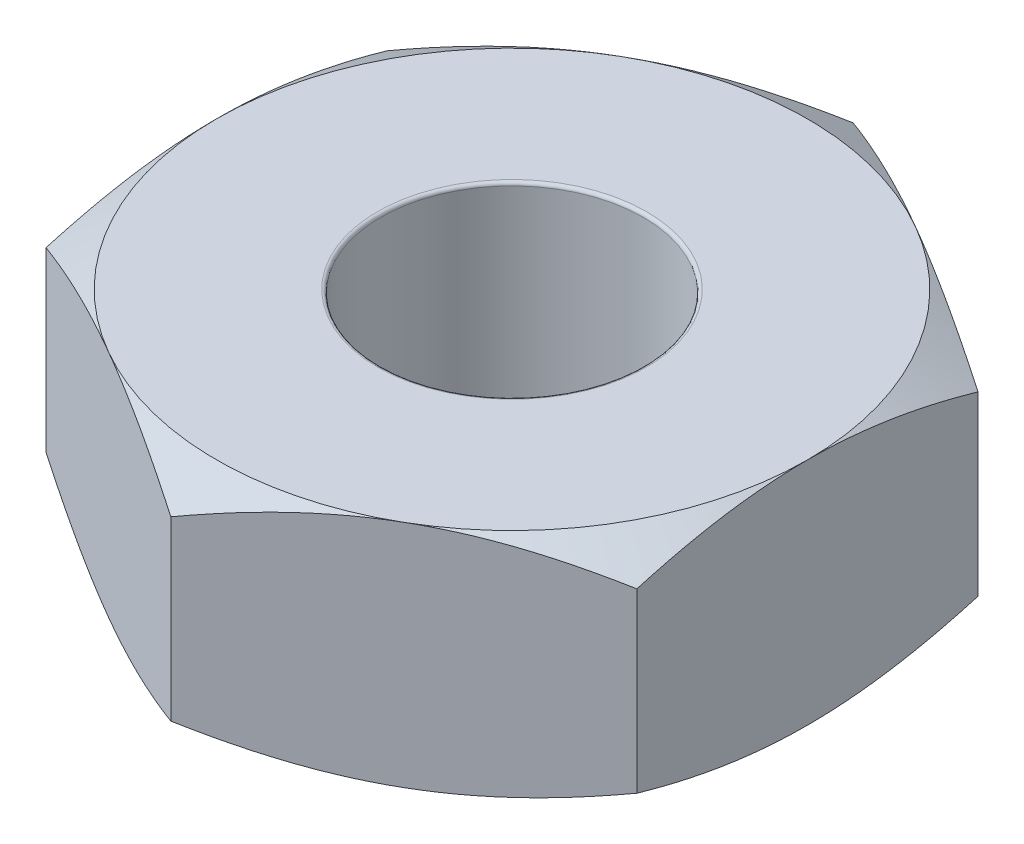
ISO-10303-21;
HEADER;
FILE_DESCRIPTION(('STEP AP214'),'2;1');
FILE_NAME('part.step','',(''),(''),'','','');
FILE_SCHEMA(('AUTOMOTIVE_DESIGN { 1 0 10303 214 1 1 1 1 }'));
ENDSEC;
DATA;
#1=APPLICATION_CONTEXT('core data for automotive mechanical design processes');
#2=APPLICATION_PROTOCOL_DEFINITION('international standard','automotive_design',2000,#1);
#3=PRODUCT_CONTEXT('',#1,'mechanical');
#4=PRODUCT('Part','Part','',(#3));
#5=PRODUCT_RELATED_PRODUCT_CATEGORY('part','',(#4));
#6=PRODUCT_DEFINITION_FORMATION('','',#4);
#7=PRODUCT_DEFINITION_CONTEXT('part definition',#1,'design');
#8=PRODUCT_DEFINITION('design','',#6,#7);
#9=PRODUCT_DEFINITION_SHAPE('','',#8);
#10=(LENGTH_UNIT() NAMED_UNIT(*) SI_UNIT(.MILLI.,.METRE.));
#11=(NAMED_UNIT(*) PLANE_ANGLE_UNIT() SI_UNIT($,.RADIAN.));
#12=(NAMED_UNIT(*) SI_UNIT($,.STERADIAN.) SOLID_ANGLE_UNIT());
#13=UNCERTAINTY_MEASURE_WITH_UNIT(LENGTH_MEASURE(1.E-05),#10,'distance_accuracy_value','');
#14=(GEOMETRIC_REPRESENTATION_CONTEXT(3) GLOBAL_UNCERTAINTY_ASSIGNED_CONTEXT((#13)) GLOBAL_UNIT_ASSIGNED_CONTEXT((#10,
#11,#12)) REPRESENTATION_CONTEXT('',''));
#15=CARTESIAN_POINT('',(0.,0.,0.));
#16=DIRECTION('',(0.,0.,1.));
#17=DIRECTION('',(1.,0.,0.));
#18=AXIS2_PLACEMENT_3D('',#15,#16,#17);
#19=CARTESIAN_POINT('',(0.,1.75,2.59807621135332));
#20=DIRECTION('',(-0.5,0.,-0.866025403784439));
#21=DIRECTION('',(-0.866025403784439,0.,0.5));
#22=AXIS2_PLACEMENT_3D('',#19,#20,#21);
#23=PLANE('',#22);
#24=CARTESIAN_POINT('',(2.2502,0.201028565434255,1.29892263562282));
#25=CARTESIAN_POINT('',(2.15132275118564,0.168055578047864,1.35600944184252));
#26=CARTESIAN_POINT('',(2.05159200282091,0.138067535415598,1.41358901625738));
#27=CARTESIAN_POINT('',(1.85040345977937,0.0857223882308784,1.52974527574028));
#28=CARTESIAN_POINT('',(1.74894208949705,0.0633838027064791,1.58832402518513));
#29=CARTESIAN_POINT('',(1.54727681019892,0.0286095576734194,1.7047555284741));
#30=CARTESIAN_POINT('',(1.44710393502333,0.0159424738337188,1.76259036492223));
#31=CARTESIAN_POINT('',(1.24628668739732,0.00081890741741927,1.87853225689703));
#32=CARTESIAN_POINT('',(1.1456430451668,-0.00165009697600117,1.93663889083104));
#33=CARTESIAN_POINT('',(0.957574835473434,0.00347837463602961,2.04522012232352));
#34=CARTESIAN_POINT('',(0.870122156108741,0.00981663451512065,2.09571095029608));
#35=CARTESIAN_POINT('',(0.695786567891225,0.0299076571898895,2.19636364908279));
#36=CARTESIAN_POINT('',(0.608904262311711,0.0436672872310841,2.24652517159694));
#37=CARTESIAN_POINT('',(0.434209045898264,0.0780662653506659,2.34738550181938));
#38=CARTESIAN_POINT('',(0.346418252564746,0.0988514715826558,2.39807153998286));
#39=CARTESIAN_POINT('',(0.172146263122404,0.14602608736298,2.49868751999961));
#40=CARTESIAN_POINT('',(0.0856628332489966,0.172404408014302,2.54861875151746));
#41=CARTESIAN_POINT('',(-0.000200000000000826,0.201028565434255,2.59819168140715));
#42=B_SPLINE_CURVE_WITH_KNOTS('',3,(#24,#25,#26,#27,#28,#29,#30,#31,#32,#33,#34,#35,#36,#37,#38,
#39,#40,#41),.UNSPECIFIED.,.F.,.F.,(4,2,2,2,2,2,2,2,4),(0.,0.356658826016553,0.714175103224236,
1.06284241804968,1.41108149062516,1.71433394539794,2.01786749258222,2.32813511279245,
2.63779325460359),.UNSPECIFIED.);
#43=CARTESIAN_POINT('',(2.25,0.200961894323341,1.29903810567666));
#44=VERTEX_POINT('',#43);
#45=CARTESIAN_POINT('',(1.125,0.,1.94855715851499));
#46=VERTEX_POINT('',#45);
#47=EDGE_CURVE('E128',#44,#46,#42,.T.);
#48=ORIENTED_EDGE('',*,*,#47,.F.);
#49=DIRECTION('',(0.,-1.,0.));
#50=VECTOR('',#49,1.);
#51=CARTESIAN_POINT('',(2.25,1.75,1.29903810567666));
#52=LINE('',#51,#50);
#53=CARTESIAN_POINT('',(2.25,1.54903810567666,1.29903810567666));
#54=VERTEX_POINT('',#53);
#55=EDGE_CURVE('E234',#54,#44,#52,.T.);
#56=ORIENTED_EDGE('',*,*,#55,.F.);
#57=CARTESIAN_POINT('',(-0.00020000000000092,1.54897143456574,2.59819168140715));
#58=CARTESIAN_POINT('',(0.0986772488143566,1.58194442195214,2.54110487518746));
#59=CARTESIAN_POINT('',(0.198407997179093,1.6119324645844,2.48352530077259));
#60=CARTESIAN_POINT('',(0.399596540220632,1.66427761176912,2.36736904128969));
#61=CARTESIAN_POINT('',(0.501057910502945,1.68661619729352,2.30879029184485));
#62=CARTESIAN_POINT('',(0.702723189801078,1.72139044232658,2.19235878855587));
#63=CARTESIAN_POINT('',(0.802896064976672,1.73405752616628,2.13452395210774));
#64=CARTESIAN_POINT('',(1.00371331260268,1.74918109258258,2.01858206013295));
#65=CARTESIAN_POINT('',(1.1043569548332,1.751650096976,1.96047542619893));
#66=CARTESIAN_POINT('',(1.29242516452656,1.74652162536397,1.85189419470646));
#67=CARTESIAN_POINT('',(1.37987784389126,1.74018336548488,1.8014033667339));
#68=CARTESIAN_POINT('',(1.55421343210877,1.72009234281011,1.70075066794718));
#69=CARTESIAN_POINT('',(1.64109573768829,1.70633271276892,1.65058914543304));
#70=CARTESIAN_POINT('',(1.81579095410174,1.67193373464933,1.54972881521059));
#71=CARTESIAN_POINT('',(1.90358174743525,1.65114852841734,1.49904277704712));
#72=CARTESIAN_POINT('',(2.07785373687759,1.60397391263702,1.39842679703037));
#73=CARTESIAN_POINT('',(2.164337166751,1.5775955919857,1.34849556551251));
#74=CARTESIAN_POINT('',(2.2502,1.54897143456575,1.29892263562282));
#75=B_SPLINE_CURVE_WITH_KNOTS('',3,(#57,#58,#59,#60,#61,#62,#63,#64,#65,#66,#67,#68,#69,#70,#71,
#72,#73,#74),.UNSPECIFIED.,.F.,.F.,(4,2,2,2,2,2,2,2,4),(0.,0.356658826016553,0.714175103224236,
1.06284241804968,1.41108149062516,1.71433394539794,2.01786749258222,2.32813511279245,
2.63779325460359),.UNSPECIFIED.);
#76=CARTESIAN_POINT('',(1.125,1.75,1.94855715851499));
#77=VERTEX_POINT('',#76);
#78=EDGE_CURVE('E375',#77,#54,#75,.T.);
#79=ORIENTED_EDGE('',*,*,#78,.F.);
#80=CARTESIAN_POINT('',(0.,1.54903810567666,2.59807621135332));
#81=VERTEX_POINT('',#80);
#82=EDGE_CURVE('E364',#81,#77,#75,.T.);
#83=ORIENTED_EDGE('',*,*,#82,.F.);
#84=DIRECTION('',(0.,-1.,0.));
#85=VECTOR('',#84,1.);
#86=CARTESIAN_POINT('',(0.,1.75,2.59807621135332));
#87=LINE('',#86,#85);
#88=CARTESIAN_POINT('',(0.,0.200961894323342,2.59807621135332));
#89=VERTEX_POINT('',#88);
#90=EDGE_CURVE('E163',#81,#89,#87,.T.);
#91=ORIENTED_EDGE('',*,*,#90,.T.);
#92=EDGE_CURVE('E141',#46,#89,#42,.T.);
#93=ORIENTED_EDGE('',*,*,#92,.F.);
#94=EDGE_LOOP('',(#48,#56,#79,#83,#91,#93));
#95=FACE_BOUND('',#94,.T.);
#96=ADVANCED_FACE('F39',(#95),#23,.F.);
#97=CARTESIAN_POINT('',(2.25,1.75,1.29903810567666));
#98=DIRECTION('',(-1.,0.,0.));
#99=DIRECTION('',(0.,0.,1.));
#100=AXIS2_PLACEMENT_3D('',#97,#98,#99);
#101=PLANE('',#100);
#102=CARTESIAN_POINT('',(2.25,1.56555831138049,-4.42213047046897));
#103=CARTESIAN_POINT('',(2.25,1.51253641089188,-4.31907609605377));
#104=CARTESIAN_POINT('',(2.25,1.45980461522268,-4.21587114895435));
#105=CARTESIAN_POINT('',(2.25,1.35506687206804,-4.00909136564838));
#106=CARTESIAN_POINT('',(2.25,1.30306093826251,-3.90551652251669));
#107=CARTESIAN_POINT('',(2.25,1.19983819414006,-3.69776226755876));
#108=CARTESIAN_POINT('',(2.25,1.14862281407765,-3.59358214386062));
#109=CARTESIAN_POINT('',(2.25,1.04726863927475,-3.38469686395629));
#110=CARTESIAN_POINT('',(2.25,0.997129859883962,-3.27999170029052));
#111=CARTESIAN_POINT('',(2.25,0.895590975392255,-3.06443773664851));
#112=CARTESIAN_POINT('',(2.25,0.844262813896655,-2.95355495083985));
#113=CARTESIAN_POINT('',(2.25,0.743488704008482,-2.73093810810308));
#114=CARTESIAN_POINT('',(2.25,0.694042704613715,-2.6192040743404));
#115=CARTESIAN_POINT('',(2.25,0.597606517380622,-2.39476559407176));
#116=CARTESIAN_POINT('',(2.25,0.550614681662906,-2.28206185948416));
#117=CARTESIAN_POINT('',(2.25,0.459779963230872,-2.05535508627362));
#118=CARTESIAN_POINT('',(2.25,0.415937817282044,-1.94135175083155));
#119=CARTESIAN_POINT('',(2.25,0.325629065729293,-1.69318584033386));
#120=CARTESIAN_POINT('',(2.25,0.279891243493502,-1.55875423344575));
#121=CARTESIAN_POINT('',(2.25,0.196186335346582,-1.28751781965288));
#122=CARTESIAN_POINT('',(2.25,0.158215303092899,-1.15071425647396));
#123=CARTESIAN_POINT('',(2.25,0.0934100246854141,-0.877191892519578));
#124=CARTESIAN_POINT('',(2.25,0.066376727658387,-0.740521481245892));
#125=CARTESIAN_POINT('',(2.25,0.0252694807344896,-0.465223193243971));
#126=CARTESIAN_POINT('',(2.25,0.0111879530299651,-0.326596509361766));
#127=CARTESIAN_POINT('',(2.25,0.00112514059449645,-0.117223951792126));
#128=CARTESIAN_POINT('',(2.25,-0.000357653579399085,-0.0467155663666356));
#129=CARTESIAN_POINT('',(2.25,0.000502767822566818,0.0942778450423053));
#130=CARTESIAN_POINT('',(2.25,0.00284598504343994,0.164762871015699));
#131=CARTESIAN_POINT('',(2.25,0.0155320953718862,0.375901114139413));
#132=CARTESIAN_POINT('',(2.25,0.0315313215434613,0.516240180351073));
#133=CARTESIAN_POINT('',(2.25,0.0769275866035944,0.797536431240897));
#134=CARTESIAN_POINT('',(2.25,0.106589144783226,0.938448674669496));
#135=CARTESIAN_POINT('',(2.25,0.176240629866023,1.21767236088611));
#136=CARTESIAN_POINT('',(2.25,0.216233678272229,1.35598300406735));
#137=CARTESIAN_POINT('',(2.25,0.301848870671621,1.62417819674141));
#138=CARTESIAN_POINT('',(2.25,0.34714996058763,1.75416736002763));
#139=CARTESIAN_POINT('',(2.25,0.44280152310107,2.01228919589808));
#140=CARTESIAN_POINT('',(2.25,0.493153199709669,2.14042141743363));
#141=CARTESIAN_POINT('',(2.25,0.597611255264982,2.39528540480934));
#142=CARTESIAN_POINT('',(2.25,0.651721394221922,2.52201561679053));
#143=CARTESIAN_POINT('',(2.25,0.762705830640599,2.77426151692869));
#144=CARTESIAN_POINT('',(2.25,0.819580277044826,2.89977713920496));
#145=CARTESIAN_POINT('',(2.25,0.932150499113665,3.14277870156182));
#146=CARTESIAN_POINT('',(2.25,0.987731600848743,3.26031797968369));
#147=CARTESIAN_POINT('',(2.25,1.10035122751634,3.49469938792213));
#148=CARTESIAN_POINT('',(2.25,1.15738979940018,3.61154149542992));
#149=CARTESIAN_POINT('',(2.25,1.27243073348915,3.84427750639044));
#150=CARTESIAN_POINT('',(2.25,1.33042936901701,3.96017325620989));
#151=CARTESIAN_POINT('',(2.25,1.44735195230743,4.19148501960206));
#152=CARTESIAN_POINT('',(2.25,1.5062758208671,4.30690107318009));
#153=CARTESIAN_POINT('',(2.25,1.56555831138049,4.42213047046897));
#154=B_SPLINE_CURVE_WITH_KNOTS('',3,(#102,#103,#104,#105,#106,#107,#108,#109,#110,#111,#112,
#113,#114,#115,#116,#117,#118,#119,#120,#121,#122,#123,#124,#125,#126,#127,#128,#129,#130,#131,
#132,#133,#134,#135,#136,#137,#138,#139,#140,#141,#142,#143,#144,#145,#146,#147,#148,#149,#150,
#151,#152,#153),.UNSPECIFIED.,.F.,.F.,(4,2,2,2,2,2,2,2,2,2,2,2,2,2,2,2,2,2,2,2,2,2,2,2,2,4),(0.,
0.347684660648866,0.695375865091879,1.04363591220691,1.39190092137216,1.75844707629515,
2.12498329159302,2.4912701408257,2.85764239361152,3.28347290105065,3.70908650157083,
4.12656251242164,4.54379411118025,4.75527202620087,4.96675003214744,5.38969802732589,
5.82120323135265,6.25283896092085,6.66567429964863,7.07860828930035,7.49196150428249,
7.90533701571905,8.2953795581992,8.68543468149342,9.07422449696779,9.46298121030579),.UNSPECIFIED.);
#155=CARTESIAN_POINT('',(2.25,0.200961894323341,-1.29903810567666));
#156=VERTEX_POINT('',#155);
#157=CARTESIAN_POINT('',(2.25,0.,0.));
#158=VERTEX_POINT('',#157);
#159=EDGE_CURVE('E54',#156,#158,#154,.T.);
#160=ORIENTED_EDGE('',*,*,#159,.F.);
#161=DIRECTION('',(0.,-1.,0.));
#162=VECTOR('',#161,1.);
#163=CARTESIAN_POINT('',(2.25,1.75,-1.29903810567666));
#164=LINE('',#163,#162);
#165=CARTESIAN_POINT('',(2.25,1.54903810567666,-1.29903810567666));
#166=VERTEX_POINT('',#165);
#167=EDGE_CURVE('E367',#166,#156,#164,.T.);
#168=ORIENTED_EDGE('',*,*,#167,.F.);
#169=CARTESIAN_POINT('',(2.25,0.18444168861951,4.42213047046897));
#170=CARTESIAN_POINT('',(2.25,0.237463589108124,4.31907609605377));
#171=CARTESIAN_POINT('',(2.25,0.290195384777317,4.21587114895435));
#172=CARTESIAN_POINT('',(2.25,0.394933127931958,4.00909136564838));
#173=CARTESIAN_POINT('',(2.25,0.446939061737492,3.90551652251669));
#174=CARTESIAN_POINT('',(2.25,0.550161805859936,3.69776226755876));
#175=CARTESIAN_POINT('',(2.25,0.601377185922347,3.59358214386062));
#176=CARTESIAN_POINT('',(2.25,0.702731360725254,3.38469686395629));
#177=CARTESIAN_POINT('',(2.25,0.752870140116038,3.27999170029052));
#178=CARTESIAN_POINT('',(2.25,0.854409024607745,3.06443773664851));
#179=CARTESIAN_POINT('',(2.25,0.905737186103345,2.95355495083985));
#180=CARTESIAN_POINT('',(2.25,1.00651129599152,2.73093810810308));
#181=CARTESIAN_POINT('',(2.25,1.05595729538628,2.6192040743404));
#182=CARTESIAN_POINT('',(2.25,1.15239348261938,2.39476559407176));
#183=CARTESIAN_POINT('',(2.25,1.19938531833709,2.28206185948416));
#184=CARTESIAN_POINT('',(2.25,1.29022003676913,2.05535508627362));
#185=CARTESIAN_POINT('',(2.25,1.33406218271796,1.94135175083155));
#186=CARTESIAN_POINT('',(2.25,1.42437093427071,1.69318584033386));
#187=CARTESIAN_POINT('',(2.25,1.4701087565065,1.55875423344575));
#188=CARTESIAN_POINT('',(2.25,1.55381366465342,1.28751781965288));
#189=CARTESIAN_POINT('',(2.25,1.5917846969071,1.15071425647396));
#190=CARTESIAN_POINT('',(2.25,1.65658997531459,0.877191892519577));
#191=CARTESIAN_POINT('',(2.25,1.68362327234161,0.740521481245891));
#192=CARTESIAN_POINT('',(2.25,1.72473051926551,0.465223193243971));
#193=CARTESIAN_POINT('',(2.25,1.73881204697003,0.326596509361766));
#194=CARTESIAN_POINT('',(2.25,1.7488748594055,0.117223951792125));
#195=CARTESIAN_POINT('',(2.25,1.7503576535794,0.046715566366635));
#196=CARTESIAN_POINT('',(2.25,1.74949723217743,-0.0942778450423061));
#197=CARTESIAN_POINT('',(2.25,1.74715401495656,-0.1647628710157));
#198=CARTESIAN_POINT('',(2.25,1.73446790462811,-0.375901114139415));
#199=CARTESIAN_POINT('',(2.25,1.71846867845654,-0.516240180351074));
#200=CARTESIAN_POINT('',(2.25,1.67307241339641,-0.797536431240898));
#201=CARTESIAN_POINT('',(2.25,1.64341085521677,-0.938448674669496));
#202=CARTESIAN_POINT('',(2.25,1.57375937013398,-1.21767236088611));
#203=CARTESIAN_POINT('',(2.25,1.53376632172777,-1.35598300406735));
#204=CARTESIAN_POINT('',(2.25,1.44815112932838,-1.62417819674141));
#205=CARTESIAN_POINT('',(2.25,1.40285003941237,-1.75416736002763));
#206=CARTESIAN_POINT('',(2.25,1.30719847689893,-2.01228919589808));
#207=CARTESIAN_POINT('',(2.25,1.25684680029033,-2.14042141743363));
#208=CARTESIAN_POINT('',(2.25,1.15238874473502,-2.39528540480934));
#209=CARTESIAN_POINT('',(2.25,1.09827860577808,-2.52201561679053));
#210=CARTESIAN_POINT('',(2.25,0.987294169359401,-2.77426151692869));
#211=CARTESIAN_POINT('',(2.25,0.930419722955175,-2.89977713920496));
#212=CARTESIAN_POINT('',(2.25,0.817849500886336,-3.14277870156182));
#213=CARTESIAN_POINT('',(2.25,0.762268399151258,-3.26031797968369));
#214=CARTESIAN_POINT('',(2.25,0.649648772483665,-3.49469938792213));
#215=CARTESIAN_POINT('',(2.25,0.592610200599821,-3.61154149542992));
#216=CARTESIAN_POINT('',(2.25,0.477569266510853,-3.84427750639044));
#217=CARTESIAN_POINT('',(2.25,0.419570630982986,-3.96017325620989));
#218=CARTESIAN_POINT('',(2.25,0.302648047692569,-4.19148501960206));
#219=CARTESIAN_POINT('',(2.25,0.243724179132897,-4.30690107318009));
#220=CARTESIAN_POINT('',(2.25,0.18444168861951,-4.42213047046897));
#221=B_SPLINE_CURVE_WITH_KNOTS('',3,(#169,#170,#171,#172,#173,#174,#175,#176,#177,#178,#179,
#180,#181,#182,#183,#184,#185,#186,#187,#188,#189,#190,#191,#192,#193,#194,#195,#196,#197,#198,
#199,#200,#201,#202,#203,#204,#205,#206,#207,#208,#209,#210,#211,#212,#213,#214,#215,#216,#217,
#218,#219,#220),.UNSPECIFIED.,.F.,.F.,(4,2,2,2,2,2,2,2,2,2,2,2,2,2,2,2,2,2,2,2,2,2,2,2,2,4),(0.,
0.347684660648866,0.695375865091879,1.04363591220691,1.39190092137216,1.75844707629515,
2.12498329159303,2.4912701408257,2.85764239361152,3.28347290105065,3.70908650157083,
4.12656251242164,4.54379411118025,4.75527202620087,4.96675003214744,5.38969802732589,
5.82120323135265,6.25283896092085,6.66567429964863,7.07860828930035,7.49196150428249,
7.90533701571905,8.2953795581992,8.68543468149342,9.07422449696779,9.46298121030579),.UNSPECIFIED.);
#222=CARTESIAN_POINT('',(2.25,1.75,0.));
#223=VERTEX_POINT('',#222);
#224=EDGE_CURVE('E274',#223,#166,#221,.T.);
#225=ORIENTED_EDGE('',*,*,#224,.F.);
#226=EDGE_CURVE('E374',#54,#223,#221,.T.);
#227=ORIENTED_EDGE('',*,*,#226,.F.);
#228=ORIENTED_EDGE('',*,*,#55,.T.);
#229=EDGE_CURVE('E135',#158,#44,#154,.T.);
#230=ORIENTED_EDGE('',*,*,#229,.F.);
#231=EDGE_LOOP('',(#160,#168,#225,#227,#228,#230));
#232=FACE_BOUND('',#231,.T.);
#233=ADVANCED_FACE('F259',(#232),#101,.F.);
#234=CARTESIAN_POINT('',(2.25,1.75,-1.29903810567666));
#235=DIRECTION('',(-0.5,0.,0.866025403784439));
#236=DIRECTION('',(0.866025403784439,0.,0.5));
#237=AXIS2_PLACEMENT_3D('',#234,#235,#236);
#238=PLANE('',#237);
#239=CARTESIAN_POINT('',(-0.000199999999999993,0.201028565434255,-2.59819168140716));
#240=CARTESIAN_POINT('',(0.0986772488143573,0.168055578047864,-2.54110487518746));
#241=CARTESIAN_POINT('',(0.198407997179094,0.138067535415598,-2.48352530077259));
#242=CARTESIAN_POINT('',(0.399596540220633,0.0857223882308785,-2.36736904128969));
#243=CARTESIAN_POINT('',(0.501057910502946,0.0633838027064793,-2.30879029184485));
#244=CARTESIAN_POINT('',(0.702723189801079,0.0286095576734195,-2.19235878855587));
#245=CARTESIAN_POINT('',(0.802896064976672,0.0159424738337188,-2.13452395210774));
#246=CARTESIAN_POINT('',(1.00371331260268,0.00081890741741929,-2.01858206013295));
#247=CARTESIAN_POINT('',(1.1043569548332,-0.00165009697600104,-1.96047542619893));
#248=CARTESIAN_POINT('',(1.29242516452657,0.00347837463602972,-1.85189419470646));
#249=CARTESIAN_POINT('',(1.37987784389126,0.00981663451512066,-1.8014033667339));
#250=CARTESIAN_POINT('',(1.55421343210877,0.0299076571898894,-1.70075066794718));
#251=CARTESIAN_POINT('',(1.64109573768829,0.0436672872310839,-1.65058914543304));
#252=CARTESIAN_POINT('',(1.81579095410174,0.0780662653506658,-1.54972881521059));
#253=CARTESIAN_POINT('',(1.90358174743525,0.0988514715826559,-1.49904277704712));
#254=CARTESIAN_POINT('',(2.07785373687759,0.14602608736298,-1.39842679703037));
#255=CARTESIAN_POINT('',(2.164337166751,0.172404408014302,-1.34849556551251));
#256=CARTESIAN_POINT('',(2.2502,0.201028565434255,-1.29892263562282));
#257=B_SPLINE_CURVE_WITH_KNOTS('',3,(#239,#240,#241,#242,#243,#244,#245,#246,#247,#248,#249,
#250,#251,#252,#253,#254,#255,#256),.UNSPECIFIED.,.F.,.F.,(4,2,2,2,2,2,2,2,4),(0.,
0.356658826016552,0.714175103224237,1.06284241804968,1.41108149062516,1.71433394539794,
2.01786749258222,2.32813511279245,2.63779325460359),.UNSPECIFIED.);
#258=CARTESIAN_POINT('',(0.,0.200961894323342,-2.59807621135332));
#259=VERTEX_POINT('',#258);
#260=CARTESIAN_POINT('',(1.125,0.,-1.94855715851499));
#261=VERTEX_POINT('',#260);
#262=EDGE_CURVE('E62',#259,#261,#257,.T.);
#263=ORIENTED_EDGE('',*,*,#262,.F.);
#264=DIRECTION('',(0.,-1.,0.));
#265=VECTOR('',#264,1.);
#266=CARTESIAN_POINT('',(0.,1.75,-2.59807621135332));
#267=LINE('',#266,#265);
#268=CARTESIAN_POINT('',(0.,1.54903810567666,-2.59807621135332));
#269=VERTEX_POINT('',#268);
#270=EDGE_CURVE('E362',#269,#259,#267,.T.);
#271=ORIENTED_EDGE('',*,*,#270,.F.);
#272=CARTESIAN_POINT('',(2.2502,1.54897143456575,-1.29892263562282));
#273=CARTESIAN_POINT('',(2.15132275118564,1.58194442195214,-1.35600944184252));
#274=CARTESIAN_POINT('',(2.05159200282091,1.6119324645844,-1.41358901625738));
#275=CARTESIAN_POINT('',(1.85040345977937,1.66427761176912,-1.52974527574028));
#276=CARTESIAN_POINT('',(1.74894208949705,1.68661619729352,-1.58832402518513));
#277=CARTESIAN_POINT('',(1.54727681019892,1.72139044232658,-1.7047555284741));
#278=CARTESIAN_POINT('',(1.44710393502333,1.73405752616628,-1.76259036492223));
#279=CARTESIAN_POINT('',(1.24628668739732,1.74918109258258,-1.87853225689703));
#280=CARTESIAN_POINT('',(1.1456430451668,1.751650096976,-1.93663889083104));
#281=CARTESIAN_POINT('',(0.957574835473435,1.74652162536397,-2.04522012232352));
#282=CARTESIAN_POINT('',(0.870122156108742,1.74018336548488,-2.09571095029608));
#283=CARTESIAN_POINT('',(0.695786567891226,1.72009234281011,-2.19636364908279));
#284=CARTESIAN_POINT('',(0.608904262311712,1.70633271276892,-2.24652517159694));
#285=CARTESIAN_POINT('',(0.434209045898264,1.67193373464933,-2.34738550181938));
#286=CARTESIAN_POINT('',(0.346418252564747,1.65114852841734,-2.39807153998286));
#287=CARTESIAN_POINT('',(0.172146263122405,1.60397391263702,-2.49868751999961));
#288=CARTESIAN_POINT('',(0.0856628332489977,1.5775955919857,-2.54861875151746));
#289=CARTESIAN_POINT('',(-0.000200000000000004,1.54897143456574,-2.59819168140715));
#290=B_SPLINE_CURVE_WITH_KNOTS('',3,(#272,#273,#274,#275,#276,#277,#278,#279,#280,#281,#282,
#283,#284,#285,#286,#287,#288,#289),.UNSPECIFIED.,.F.,.F.,(4,2,2,2,2,2,2,2,4),(0.,
0.356658826016552,0.714175103224236,1.06284241804968,1.41108149062516,1.71433394539794,
2.01786749258222,2.32813511279245,2.63779325460359),.UNSPECIFIED.);
#291=CARTESIAN_POINT('',(1.125,1.75,-1.94855715851499));
#292=VERTEX_POINT('',#291);
#293=EDGE_CURVE('E323',#292,#269,#290,.T.);
#294=ORIENTED_EDGE('',*,*,#293,.F.);
#295=EDGE_CURVE('E381',#166,#292,#290,.T.);
#296=ORIENTED_EDGE('',*,*,#295,.F.);
#297=ORIENTED_EDGE('',*,*,#167,.T.);
#298=EDGE_CURVE('E201',#261,#156,#257,.T.);
#299=ORIENTED_EDGE('',*,*,#298,.F.);
#300=EDGE_LOOP('',(#263,#271,#294,#296,#297,#299));
#301=FACE_BOUND('',#300,.T.);
#302=ADVANCED_FACE('F263',(#301),#238,.F.);
#303=CARTESIAN_POINT('',(0.,1.75,-2.59807621135332));
#304=DIRECTION('',(0.5,0.,0.866025403784439));
#305=DIRECTION('',(0.866025403784439,0.,-0.5));
#306=AXIS2_PLACEMENT_3D('',#303,#304,#305);
#307=PLANE('',#306);
#308=CARTESIAN_POINT('',(-2.2502,0.201028565434256,-1.29892263562282));
#309=CARTESIAN_POINT('',(-2.15132275118564,0.168055578047865,-1.35600944184252));
#310=CARTESIAN_POINT('',(-2.05159200282091,0.138067535415599,-1.41358901625738));
#311=CARTESIAN_POINT('',(-1.85040345977937,0.0857223882308788,-1.52974527574028));
#312=CARTESIAN_POINT('',(-1.74894208949706,0.0633838027064795,-1.58832402518513));
#313=CARTESIAN_POINT('',(-1.54727681019892,0.0286095576734196,-1.7047555284741));
#314=CARTESIAN_POINT('',(-1.44710393502333,0.0159424738337189,-1.76259036492223));
#315=CARTESIAN_POINT('',(-1.24628668739732,0.000818907417419567,-1.87853225689703));
#316=CARTESIAN_POINT('',(-1.1456430451668,-0.0016500969760006,-1.93663889083104));
#317=CARTESIAN_POINT('',(-0.957574835473435,0.00347837463603016,-2.04522012232352));
#318=CARTESIAN_POINT('',(-0.870122156108742,0.00981663451512098,-2.09571095029608));
#319=CARTESIAN_POINT('',(-0.695786567891226,0.0299076571898897,-2.19636364908279));
#320=CARTESIAN_POINT('',(-0.608904262311712,0.0436672872310844,-2.24652517159694));
#321=CARTESIAN_POINT('',(-0.434209045898264,0.0780662653506663,-2.34738550181938));
#322=CARTESIAN_POINT('',(-0.346418252564746,0.0988514715826562,-2.39807153998286));
#323=CARTESIAN_POINT('',(-0.172146263122405,0.14602608736298,-2.49868751999961));
#324=CARTESIAN_POINT('',(-0.0856628332489973,0.172404408014303,-2.54861875151746));
#325=CARTESIAN_POINT('',(0.000200000000000086,0.201028565434255,-2.59819168140716));
#326=B_SPLINE_CURVE_WITH_KNOTS('',3,(#308,#309,#310,#311,#312,#313,#314,#315,#316,#317,#318,
#319,#320,#321,#322,#323,#324,#325),.UNSPECIFIED.,.F.,.F.,(4,2,2,2,2,2,2,2,4),(0.,
0.356658826016553,0.714175103224237,1.06284241804968,1.41108149062516,1.71433394539794,
2.01786749258222,2.32813511279245,2.63779325460359),.UNSPECIFIED.);
#327=CARTESIAN_POINT('',(-2.25,0.200961894323336,-1.29903810567667));
#328=VERTEX_POINT('',#327);
#329=CARTESIAN_POINT('',(-1.125,0.,-1.94855715851499));
#330=VERTEX_POINT('',#329);
#331=EDGE_CURVE('E179',#328,#330,#326,.T.);
#332=ORIENTED_EDGE('',*,*,#331,.F.);
#333=DIRECTION('',(0.,-1.,0.));
#334=VECTOR('',#333,1.);
#335=CARTESIAN_POINT('',(-2.25,1.75,-1.29903810567666));
#336=LINE('',#335,#334);
#337=CARTESIAN_POINT('',(-2.25,1.54903810567666,-1.29903810567666));
#338=VERTEX_POINT('',#337);
#339=EDGE_CURVE('E330',#338,#328,#336,.T.);
#340=ORIENTED_EDGE('',*,*,#339,.F.);
#341=CARTESIAN_POINT('',(0.00020000000000006,1.54897143456574,-2.59819168140716));
#342=CARTESIAN_POINT('',(-0.0986772488143573,1.58194442195214,-2.54110487518746));
#343=CARTESIAN_POINT('',(-0.198407997179094,1.6119324645844,-2.48352530077259));
#344=CARTESIAN_POINT('',(-0.399596540220633,1.66427761176912,-2.36736904128969));
#345=CARTESIAN_POINT('',(-0.501057910502946,1.68661619729352,-2.30879029184485));
#346=CARTESIAN_POINT('',(-0.702723189801079,1.72139044232658,-2.19235878855587));
#347=CARTESIAN_POINT('',(-0.802896064976672,1.73405752616628,-2.13452395210774));
#348=CARTESIAN_POINT('',(-1.00371331260268,1.74918109258258,-2.01858206013295));
#349=CARTESIAN_POINT('',(-1.1043569548332,1.751650096976,-1.96047542619893));
#350=CARTESIAN_POINT('',(-1.29242516452657,1.74652162536397,-1.85189419470646));
#351=CARTESIAN_POINT('',(-1.37987784389126,1.74018336548488,-1.8014033667339));
#352=CARTESIAN_POINT('',(-1.55421343210877,1.72009234281011,-1.70075066794718));
#353=CARTESIAN_POINT('',(-1.64109573768829,1.70633271276892,-1.65058914543304));
#354=CARTESIAN_POINT('',(-1.81579095410174,1.67193373464933,-1.54972881521059));
#355=CARTESIAN_POINT('',(-1.90358174743525,1.65114852841734,-1.49904277704712));
#356=CARTESIAN_POINT('',(-2.0778537368776,1.60397391263702,-1.39842679703037));
#357=CARTESIAN_POINT('',(-2.164337166751,1.5775955919857,-1.34849556551251));
#358=CARTESIAN_POINT('',(-2.2502,1.54897143456574,-1.29892263562282));
#359=B_SPLINE_CURVE_WITH_KNOTS('',3,(#341,#342,#343,#344,#345,#346,#347,#348,#349,#350,#351,
#352,#353,#354,#355,#356,#357,#358),.UNSPECIFIED.,.F.,.F.,(4,2,2,2,2,2,2,2,4),(0.,
0.356658826016552,0.714175103224236,1.06284241804968,1.41108149062516,1.71433394539794,
2.01786749258222,2.32813511279245,2.63779325460359),.UNSPECIFIED.);
#360=CARTESIAN_POINT('',(-1.125,1.75,-1.94855715851499));
#361=VERTEX_POINT('',#360);
#362=EDGE_CURVE('E314',#361,#338,#359,.T.);
#363=ORIENTED_EDGE('',*,*,#362,.F.);
#364=EDGE_CURVE('E319',#269,#361,#359,.T.);
#365=ORIENTED_EDGE('',*,*,#364,.F.);
#366=ORIENTED_EDGE('',*,*,#270,.T.);
#367=EDGE_CURVE('E285',#330,#259,#326,.T.);
#368=ORIENTED_EDGE('',*,*,#367,.F.);
#369=EDGE_LOOP('',(#332,#340,#363,#365,#366,#368));
#370=FACE_BOUND('',#369,.T.);
#371=ADVANCED_FACE('F268',(#370),#307,.F.);
#372=CARTESIAN_POINT('',(-2.25,1.75,-1.29903810567666));
#373=DIRECTION('',(1.,0.,0.));
#374=DIRECTION('',(0.,0.,-1.));
#375=AXIS2_PLACEMENT_3D('',#372,#373,#374);
#376=PLANE('',#375);
#377=CARTESIAN_POINT('',(-2.25,1.56555831138049,4.42213047046897));
#378=CARTESIAN_POINT('',(-2.25,1.51253641089188,4.31907609605377));
#379=CARTESIAN_POINT('',(-2.25,1.45980461522268,4.21587114895435));
#380=CARTESIAN_POINT('',(-2.25,1.35506687206804,4.00909136564838));
#381=CARTESIAN_POINT('',(-2.25,1.30306093826251,3.90551652251669));
#382=CARTESIAN_POINT('',(-2.25,1.19983819414006,3.69776226755876));
#383=CARTESIAN_POINT('',(-2.25,1.14862281407765,3.59358214386062));
#384=CARTESIAN_POINT('',(-2.25,1.04726863927475,3.38469686395628));
#385=CARTESIAN_POINT('',(-2.25,0.997129859883961,3.27999170029052));
#386=CARTESIAN_POINT('',(-2.25,0.895590975392254,3.06443773664851));
#387=CARTESIAN_POINT('',(-2.25,0.844262813896655,2.95355495083985));
#388=CARTESIAN_POINT('',(-2.25,0.743488704008482,2.73093810810308));
#389=CARTESIAN_POINT('',(-2.25,0.694042704613715,2.6192040743404));
#390=CARTESIAN_POINT('',(-2.25,0.597606517380622,2.39476559407176));
#391=CARTESIAN_POINT('',(-2.25,0.550614681662906,2.28206185948416));
#392=CARTESIAN_POINT('',(-2.25,0.459779963230871,2.05535508627361));
#393=CARTESIAN_POINT('',(-2.25,0.415937817282044,1.94135175083155));
#394=CARTESIAN_POINT('',(-2.25,0.325629065729293,1.69318584033386));
#395=CARTESIAN_POINT('',(-2.25,0.279891243493502,1.55875423344575));
#396=CARTESIAN_POINT('',(-2.25,0.196186335346582,1.28751781965287));
#397=CARTESIAN_POINT('',(-2.25,0.158215303092899,1.15071425647396));
#398=CARTESIAN_POINT('',(-2.25,0.0934100246854144,0.877191892519574));
#399=CARTESIAN_POINT('',(-2.25,0.0663767276583875,0.740521481245888));
#400=CARTESIAN_POINT('',(-2.25,0.02526948073449,0.465223193243968));
#401=CARTESIAN_POINT('',(-2.25,0.0111879530299654,0.326596509361763));
#402=CARTESIAN_POINT('',(-2.25,0.00112514059449726,0.117223951792123));
#403=CARTESIAN_POINT('',(-2.25,-0.000357653579397994,0.0467155663666322));
#404=CARTESIAN_POINT('',(-2.25,0.000502767822567976,-0.0942778450423087));
#405=CARTESIAN_POINT('',(-2.25,0.00284598504344088,-0.164762871015703));
#406=CARTESIAN_POINT('',(-2.25,0.0155320953718869,-0.375901114139417));
#407=CARTESIAN_POINT('',(-2.25,0.0315313215434624,-0.516240180351076));
#408=CARTESIAN_POINT('',(-2.25,0.0769275866035959,-0.797536431240901));
#409=CARTESIAN_POINT('',(-2.25,0.106589144783227,-0.938448674669499));
#410=CARTESIAN_POINT('',(-2.25,0.176240629866024,-1.21767236088611));
#411=CARTESIAN_POINT('',(-2.25,0.216233678272231,-1.35598300406735));
#412=CARTESIAN_POINT('',(-2.25,0.301848870671623,-1.62417819674141));
#413=CARTESIAN_POINT('',(-2.25,0.347149960587632,-1.75416736002763));
#414=CARTESIAN_POINT('',(-2.25,0.442801523101072,-2.01228919589808));
#415=CARTESIAN_POINT('',(-2.25,0.49315319970967,-2.14042141743363));
#416=CARTESIAN_POINT('',(-2.25,0.597611255264982,-2.39528540480934));
#417=CARTESIAN_POINT('',(-2.25,0.651721394221923,-2.52201561679053));
#418=CARTESIAN_POINT('',(-2.25,0.7627058306406,-2.77426151692869));
#419=CARTESIAN_POINT('',(-2.25,0.819580277044826,-2.89977713920496));
#420=CARTESIAN_POINT('',(-2.25,0.932150499113665,-3.14277870156182));
#421=CARTESIAN_POINT('',(-2.25,0.987731600848743,-3.26031797968369));
#422=CARTESIAN_POINT('',(-2.25,1.10035122751634,-3.49469938792213));
#423=CARTESIAN_POINT('',(-2.25,1.15738979940018,-3.61154149542992));
#424=CARTESIAN_POINT('',(-2.25,1.27243073348915,-3.84427750639044));
#425=CARTESIAN_POINT('',(-2.25,1.33042936901701,-3.96017325620989));
#426=CARTESIAN_POINT('',(-2.25,1.44735195230743,-4.19148501960206));
#427=CARTESIAN_POINT('',(-2.25,1.5062758208671,-4.30690107318009));
#428=CARTESIAN_POINT('',(-2.25,1.56555831138049,-4.42213047046897));
#429=B_SPLINE_CURVE_WITH_KNOTS('',3,(#377,#378,#379,#380,#381,#382,#383,#384,#385,#386,#387,
#388,#389,#390,#391,#392,#393,#394,#395,#396,#397,#398,#399,#400,#401,#402,#403,#404,#405,#406,
#407,#408,#409,#410,#411,#412,#413,#414,#415,#416,#417,#418,#419,#420,#421,#422,#423,#424,#425,
#426,#427,#428),.UNSPECIFIED.,.F.,.F.,(4,2,2,2,2,2,2,2,2,2,2,2,2,2,2,2,2,2,2,2,2,2,2,2,2,4),(0.,
0.347684660648865,0.695375865091879,1.04363591220691,1.39190092137216,1.75844707629515,
2.12498329159302,2.4912701408257,2.85764239361152,3.28347290105065,3.70908650157083,
4.12656251242164,4.54379411118025,4.75527202620087,4.96675003214744,5.38969802732589,
5.82120323135264,6.25283896092085,6.66567429964863,7.07860828930034,7.49196150428248,
7.90533701571905,8.29537955819919,8.68543468149341,9.07422449696779,9.46298121030579),.UNSPECIFIED.);
#430=CARTESIAN_POINT('',(-2.25,0.200961894323342,1.29903810567666));
#431=VERTEX_POINT('',#430);
#432=CARTESIAN_POINT('',(-2.25,0.,0.));
#433=VERTEX_POINT('',#432);
#434=EDGE_CURVE('E164',#431,#433,#429,.T.);
#435=ORIENTED_EDGE('',*,*,#434,.F.);
#436=DIRECTION('',(0.,-1.,0.));
#437=VECTOR('',#436,1.);
#438=CARTESIAN_POINT('',(-2.25,1.75,1.29903810567666));
#439=LINE('',#438,#437);
#440=CARTESIAN_POINT('',(-2.25,1.54903810567666,1.29903810567666));
#441=VERTEX_POINT('',#440);
#442=EDGE_CURVE('E356',#441,#431,#439,.T.);
#443=ORIENTED_EDGE('',*,*,#442,.F.);
#444=CARTESIAN_POINT('',(-2.25,0.18444168861951,-4.42213047046897));
#445=CARTESIAN_POINT('',(-2.25,0.237463589108124,-4.31907609605377));
#446=CARTESIAN_POINT('',(-2.25,0.290195384777318,-4.21587114895435));
#447=CARTESIAN_POINT('',(-2.25,0.394933127931958,-4.00909136564838));
#448=CARTESIAN_POINT('',(-2.25,0.446939061737492,-3.90551652251669));
#449=CARTESIAN_POINT('',(-2.25,0.550161805859937,-3.69776226755876));
#450=CARTESIAN_POINT('',(-2.25,0.601377185922348,-3.59358214386062));
#451=CARTESIAN_POINT('',(-2.25,0.702731360725255,-3.38469686395629));
#452=CARTESIAN_POINT('',(-2.25,0.752870140116038,-3.27999170029052));
#453=CARTESIAN_POINT('',(-2.25,0.854409024607745,-3.06443773664851));
#454=CARTESIAN_POINT('',(-2.25,0.905737186103345,-2.95355495083985));
#455=CARTESIAN_POINT('',(-2.25,1.00651129599152,-2.73093810810308));
#456=CARTESIAN_POINT('',(-2.25,1.05595729538628,-2.6192040743404));
#457=CARTESIAN_POINT('',(-2.25,1.15239348261938,-2.39476559407176));
#458=CARTESIAN_POINT('',(-2.25,1.19938531833709,-2.28206185948416));
#459=CARTESIAN_POINT('',(-2.25,1.29022003676913,-2.05535508627361));
#460=CARTESIAN_POINT('',(-2.25,1.33406218271796,-1.94135175083155));
#461=CARTESIAN_POINT('',(-2.25,1.42437093427071,-1.69318584033386));
#462=CARTESIAN_POINT('',(-2.25,1.4701087565065,-1.55875423344575));
#463=CARTESIAN_POINT('',(-2.25,1.55381366465342,-1.28751781965287));
#464=CARTESIAN_POINT('',(-2.25,1.5917846969071,-1.15071425647396));
#465=CARTESIAN_POINT('',(-2.25,1.65658997531459,-0.877191892519575));
#466=CARTESIAN_POINT('',(-2.25,1.68362327234161,-0.740521481245889));
#467=CARTESIAN_POINT('',(-2.25,1.72473051926551,-0.465223193243968));
#468=CARTESIAN_POINT('',(-2.25,1.73881204697003,-0.326596509361763));
#469=CARTESIAN_POINT('',(-2.25,1.7488748594055,-0.117223951792123));
#470=CARTESIAN_POINT('',(-2.25,1.7503576535794,-0.0467155663666323));
#471=CARTESIAN_POINT('',(-2.25,1.74949723217743,0.0942778450423088));
#472=CARTESIAN_POINT('',(-2.25,1.74715401495656,0.164762871015703));
#473=CARTESIAN_POINT('',(-2.25,1.73446790462811,0.375901114139418));
#474=CARTESIAN_POINT('',(-2.25,1.71846867845654,0.516240180351077));
#475=CARTESIAN_POINT('',(-2.25,1.6730724133964,0.797536431240902));
#476=CARTESIAN_POINT('',(-2.25,1.64341085521677,0.9384486746695));
#477=CARTESIAN_POINT('',(-2.25,1.57375937013398,1.21767236088611));
#478=CARTESIAN_POINT('',(-2.25,1.53376632172777,1.35598300406736));
#479=CARTESIAN_POINT('',(-2.25,1.44815112932838,1.62417819674141));
#480=CARTESIAN_POINT('',(-2.25,1.40285003941237,1.75416736002763));
#481=CARTESIAN_POINT('',(-2.25,1.30719847689893,2.01228919589808));
#482=CARTESIAN_POINT('',(-2.25,1.25684680029033,2.14042141743363));
#483=CARTESIAN_POINT('',(-2.25,1.15238874473502,2.39528540480934));
#484=CARTESIAN_POINT('',(-2.25,1.09827860577808,2.52201561679053));
#485=CARTESIAN_POINT('',(-2.25,0.987294169359401,2.77426151692869));
#486=CARTESIAN_POINT('',(-2.25,0.930419722955174,2.89977713920496));
#487=CARTESIAN_POINT('',(-2.25,0.817849500886335,3.14277870156182));
#488=CARTESIAN_POINT('',(-2.25,0.762268399151258,3.26031797968369));
#489=CARTESIAN_POINT('',(-2.25,0.649648772483666,3.49469938792213));
#490=CARTESIAN_POINT('',(-2.25,0.592610200599822,3.61154149542992));
#491=CARTESIAN_POINT('',(-2.25,0.477569266510854,3.84427750639044));
#492=CARTESIAN_POINT('',(-2.25,0.419570630982987,3.96017325620989));
#493=CARTESIAN_POINT('',(-2.25,0.302648047692569,4.19148501960206));
#494=CARTESIAN_POINT('',(-2.25,0.243724179132898,4.30690107318009));
#495=CARTESIAN_POINT('',(-2.25,0.184441688619511,4.42213047046897));
#496=B_SPLINE_CURVE_WITH_KNOTS('',3,(#444,#445,#446,#447,#448,#449,#450,#451,#452,#453,#454,
#455,#456,#457,#458,#459,#460,#461,#462,#463,#464,#465,#466,#467,#468,#469,#470,#471,#472,#473,
#474,#475,#476,#477,#478,#479,#480,#481,#482,#483,#484,#485,#486,#487,#488,#489,#490,#491,#492,
#493,#494,#495),.UNSPECIFIED.,.F.,.F.,(4,2,2,2,2,2,2,2,2,2,2,2,2,2,2,2,2,2,2,2,2,2,2,2,2,4),(0.,
0.347684660648866,0.69537586509188,1.04363591220691,1.39190092137216,1.75844707629515,
2.12498329159303,2.4912701408257,2.85764239361152,3.28347290105065,3.70908650157083,
4.12656251242164,4.54379411118025,4.75527202620087,4.96675003214744,5.38969802732589,
5.82120323135265,6.25283896092086,6.66567429964863,7.07860828930035,7.49196150428249,
7.90533701571905,8.29537955819919,8.68543468149342,9.07422449696779,9.46298121030579),.UNSPECIFIED.);
#497=CARTESIAN_POINT('',(-2.25,1.75,0.));
#498=VERTEX_POINT('',#497);
#499=EDGE_CURVE('E301',#498,#441,#496,.T.);
#500=ORIENTED_EDGE('',*,*,#499,.F.);
#501=EDGE_CURVE('E305',#338,#498,#496,.T.);
#502=ORIENTED_EDGE('',*,*,#501,.F.);
#503=ORIENTED_EDGE('',*,*,#339,.T.);
#504=EDGE_CURVE('E140',#433,#328,#429,.T.);
#505=ORIENTED_EDGE('',*,*,#504,.F.);
#506=EDGE_LOOP('',(#435,#443,#500,#502,#503,#505));
#507=FACE_BOUND('',#506,.T.);
#508=ADVANCED_FACE('F222',(#507),#376,.F.);
#509=CARTESIAN_POINT('',(-2.25,1.75,1.29903810567666));
#510=DIRECTION('',(0.5,0.,-0.866025403784438));
#511=DIRECTION('',(-0.866025403784439,0.,-0.5));
#512=AXIS2_PLACEMENT_3D('',#509,#510,#511);
#513=PLANE('',#512);
#514=CARTESIAN_POINT('',(0.000199999999999148,0.201028565434255,2.59819168140715));
#515=CARTESIAN_POINT('',(-0.0986772488143582,0.168055578047864,2.54110487518746));
#516=CARTESIAN_POINT('',(-0.198407997179094,0.138067535415598,2.48352530077259));
#517=CARTESIAN_POINT('',(-0.399596540220634,0.0857223882308785,2.36736904128969));
#518=CARTESIAN_POINT('',(-0.501057910502946,0.0633838027064791,2.30879029184485));
#519=CARTESIAN_POINT('',(-0.70272318980108,0.0286095576734194,2.19235878855587));
#520=CARTESIAN_POINT('',(-0.802896064976673,0.0159424738337189,2.13452395210774));
#521=CARTESIAN_POINT('',(-1.00371331260268,0.000818907417419439,2.01858206013295));
#522=CARTESIAN_POINT('',(-1.1043569548332,-0.00165009697600101,1.96047542619893));
#523=CARTESIAN_POINT('',(-1.29242516452657,0.0034783746360297,1.85189419470646));
#524=CARTESIAN_POINT('',(-1.37987784389126,0.0098166345151207,1.8014033667339));
#525=CARTESIAN_POINT('',(-1.55421343210878,0.0299076571898895,1.70075066794718));
#526=CARTESIAN_POINT('',(-1.64109573768829,0.0436672872310841,1.65058914543304));
#527=CARTESIAN_POINT('',(-1.81579095410174,0.078066265350666,1.54972881521059));
#528=CARTESIAN_POINT('',(-1.90358174743525,0.098851471582656,1.49904277704711));
#529=CARTESIAN_POINT('',(-2.0778537368776,0.14602608736298,1.39842679703037));
#530=CARTESIAN_POINT('',(-2.164337166751,0.172404408014303,1.34849556551251));
#531=CARTESIAN_POINT('',(-2.2502,0.201028565434255,1.29892263562282));
#532=B_SPLINE_CURVE_WITH_KNOTS('',3,(#514,#515,#516,#517,#518,#519,#520,#521,#522,#523,#524,
#525,#526,#527,#528,#529,#530,#531),.UNSPECIFIED.,.F.,.F.,(4,2,2,2,2,2,2,2,4),(0.,
0.356658826016552,0.714175103224236,1.06284241804968,1.41108149062516,1.71433394539794,
2.01786749258222,2.32813511279245,2.63779325460359),.UNSPECIFIED.);
#533=CARTESIAN_POINT('',(-1.125,0.,1.94855715851499));
#534=VERTEX_POINT('',#533);
#535=EDGE_CURVE('E148',#89,#534,#532,.T.);
#536=ORIENTED_EDGE('',*,*,#535,.F.);
#537=ORIENTED_EDGE('',*,*,#90,.F.);
#538=CARTESIAN_POINT('',(-2.2502,1.54897143456574,1.29892263562282));
#539=CARTESIAN_POINT('',(-2.15132275118564,1.58194442195214,1.35600944184252));
#540=CARTESIAN_POINT('',(-2.05159200282091,1.6119324645844,1.41358901625738));
#541=CARTESIAN_POINT('',(-1.85040345977937,1.66427761176912,1.52974527574028));
#542=CARTESIAN_POINT('',(-1.74894208949706,1.68661619729352,1.58832402518513));
#543=CARTESIAN_POINT('',(-1.54727681019892,1.72139044232658,1.7047555284741));
#544=CARTESIAN_POINT('',(-1.44710393502333,1.73405752616628,1.76259036492223));
#545=CARTESIAN_POINT('',(-1.24628668739732,1.74918109258258,1.87853225689703));
#546=CARTESIAN_POINT('',(-1.1456430451668,1.751650096976,1.93663889083104));
#547=CARTESIAN_POINT('',(-0.957574835473436,1.74652162536397,2.04522012232352));
#548=CARTESIAN_POINT('',(-0.870122156108743,1.74018336548488,2.09571095029608));
#549=CARTESIAN_POINT('',(-0.695786567891227,1.72009234281011,2.19636364908279));
#550=CARTESIAN_POINT('',(-0.608904262311713,1.70633271276892,2.24652517159694));
#551=CARTESIAN_POINT('',(-0.434209045898265,1.67193373464933,2.34738550181938));
#552=CARTESIAN_POINT('',(-0.346418252564748,1.65114852841734,2.39807153998286));
#553=CARTESIAN_POINT('',(-0.172146263122406,1.60397391263702,2.49868751999961));
#554=CARTESIAN_POINT('',(-0.0856628332489988,1.5775955919857,2.54861875151746));
#555=CARTESIAN_POINT('',(0.00019999999999885,1.54897143456575,2.59819168140715));
#556=B_SPLINE_CURVE_WITH_KNOTS('',3,(#538,#539,#540,#541,#542,#543,#544,#545,#546,#547,#548,
#549,#550,#551,#552,#553,#554,#555),.UNSPECIFIED.,.F.,.F.,(4,2,2,2,2,2,2,2,4),(0.,
0.356658826016552,0.714175103224236,1.06284241804968,1.41108149062516,1.71433394539794,
2.01786749258222,2.32813511279245,2.63779325460359),.UNSPECIFIED.);
#557=CARTESIAN_POINT('',(-1.125,1.75,1.94855715851499));
#558=VERTEX_POINT('',#557);
#559=EDGE_CURVE('E228',#558,#81,#556,.T.);
#560=ORIENTED_EDGE('',*,*,#559,.F.);
#561=EDGE_CURVE('E153',#441,#558,#556,.T.);
#562=ORIENTED_EDGE('',*,*,#561,.F.);
#563=ORIENTED_EDGE('',*,*,#442,.T.);
#564=EDGE_CURVE('E210',#534,#431,#532,.T.);
#565=ORIENTED_EDGE('',*,*,#564,.F.);
#566=EDGE_LOOP('',(#536,#537,#560,#562,#563,#565));
#567=FACE_BOUND('',#566,.T.);
#568=ADVANCED_FACE('F218',(#567),#513,.F.);
#569=CARTESIAN_POINT('',(0.,0.,0.));
#570=DIRECTION('',(0.,1.,0.));
#571=DIRECTION('',(0.,0.,1.));
#572=AXIS2_PLACEMENT_3D('',#569,#570,#571);
#573=PLANE('',#572);
#574=CARTESIAN_POINT('',(0.,0.,0.));
#575=DIRECTION('',(0.,1.,0.));
#576=DIRECTION('',(0.,0.,1.));
#577=AXIS2_PLACEMENT_3D('',#574,#575,#576);
#578=CIRCLE('',#577,1.025);
#579=CARTESIAN_POINT('',(0.,0.,1.025));
#580=VERTEX_POINT('',#579);
#581=EDGE_CURVE('E158',#580,#580,#578,.T.);
#582=ORIENTED_EDGE('',*,*,#581,.T.);
#583=EDGE_LOOP('',(#582));
#584=FACE_BOUND('',#583,.T.);
#585=CARTESIAN_POINT('',(0.,0.,0.));
#586=DIRECTION('',(0.,1.,0.));
#587=DIRECTION('',(0.,0.,1.));
#588=AXIS2_PLACEMENT_3D('',#585,#586,#587);
#589=CIRCLE('',#588,2.25);
#590=EDGE_CURVE('E132',#46,#158,#589,.T.);
#591=ORIENTED_EDGE('',*,*,#590,.F.);
#592=EDGE_CURVE('E145',#534,#46,#589,.T.);
#593=ORIENTED_EDGE('',*,*,#592,.F.);
#594=EDGE_CURVE('E152',#433,#534,#589,.T.);
#595=ORIENTED_EDGE('',*,*,#594,.F.);
#596=EDGE_CURVE('E535',#330,#433,#589,.T.);
#597=ORIENTED_EDGE('',*,*,#596,.F.);
#598=EDGE_CURVE('E159',#261,#330,#589,.T.);
#599=ORIENTED_EDGE('',*,*,#598,.F.);
#600=CARTESIAN_POINT('',(0.,0.,0.));
#601=DIRECTION('',(0.,-1.,0.));
#602=DIRECTION('',(0.,0.,-1.));
#603=AXIS2_PLACEMENT_3D('',#600,#601,#602);
#604=CIRCLE('',#603,2.25);
#605=EDGE_CURVE('E157',#261,#158,#604,.T.);
#606=ORIENTED_EDGE('',*,*,#605,.T.);
#607=EDGE_LOOP('',(#591,#593,#595,#597,#599,#606));
#608=FACE_BOUND('',#607,.T.);
#609=ADVANCED_FACE('F155',(#584,#608),#573,.F.);
#610=CARTESIAN_POINT('',(0.,1.75,0.));
#611=DIRECTION('',(0.,1.,0.));
#612=DIRECTION('',(0.,0.,1.));
#613=AXIS2_PLACEMENT_3D('',#610,#611,#612);
#614=PLANE('',#613);
#615=CARTESIAN_POINT('',(0.,1.75,0.));
#616=DIRECTION('',(0.,1.,0.));
#617=DIRECTION('',(0.,0.,1.));
#618=AXIS2_PLACEMENT_3D('',#615,#616,#617);
#619=CIRCLE('',#618,1.025);
#620=CARTESIAN_POINT('',(0.,1.75,1.025));
#621=VERTEX_POINT('',#620);
#622=EDGE_CURVE('E12',#621,#621,#619,.F.);
#623=ORIENTED_EDGE('',*,*,#622,.T.);
#624=EDGE_LOOP('',(#623));
#625=FACE_BOUND('',#624,.T.);
#626=CARTESIAN_POINT('',(0.,1.75,0.));
#627=DIRECTION('',(0.,1.,0.));
#628=DIRECTION('',(0.,0.,1.));
#629=AXIS2_PLACEMENT_3D('',#626,#627,#628);
#630=CIRCLE('',#629,2.25);
#631=EDGE_CURVE('E291',#558,#77,#630,.T.);
#632=ORIENTED_EDGE('',*,*,#631,.T.);
#633=EDGE_CURVE('E294',#77,#223,#630,.T.);
#634=ORIENTED_EDGE('',*,*,#633,.T.);
#635=EDGE_CURVE('E302',#223,#292,#630,.T.);
#636=ORIENTED_EDGE('',*,*,#635,.T.);
#637=EDGE_CURVE('E306',#292,#361,#630,.T.);
#638=ORIENTED_EDGE('',*,*,#637,.T.);
#639=EDGE_CURVE('E299',#361,#498,#630,.T.);
#640=ORIENTED_EDGE('',*,*,#639,.T.);
#641=EDGE_CURVE('E293',#498,#558,#630,.T.);
#642=ORIENTED_EDGE('',*,*,#641,.T.);
#643=EDGE_LOOP('',(#632,#634,#636,#638,#640,#642));
#644=FACE_BOUND('',#643,.T.);
#645=ADVANCED_FACE('F253',(#625,#644),#614,.T.);
#646=CARTESIAN_POINT('',(0.,1.75,0.));
#647=DIRECTION('',(0.,-1.,0.));
#648=DIRECTION('',(0.,0.,-1.));
#649=AXIS2_PLACEMENT_3D('',#646,#647,#648);
#650=CYLINDRICAL_SURFACE('',#649,1.);
#651=CARTESIAN_POINT('',(0.,0.0250000000000001,0.));
#652=DIRECTION('',(0.,1.,0.));
#653=DIRECTION('',(0.,0.,1.));
#654=AXIS2_PLACEMENT_3D('',#651,#652,#653);
#655=CIRCLE('',#654,1.);
#656=CARTESIAN_POINT('',(0.,0.0250000000000001,1.));
#657=VERTEX_POINT('',#656);
#658=EDGE_CURVE('E47',#657,#657,#655,.F.);
#659=ORIENTED_EDGE('',*,*,#658,.T.);
#660=EDGE_LOOP('',(#659));
#661=FACE_BOUND('',#660,.T.);
#662=CARTESIAN_POINT('',(0.,1.725,0.));
#663=DIRECTION('',(0.,1.,0.));
#664=DIRECTION('',(0.,0.,1.));
#665=AXIS2_PLACEMENT_3D('',#662,#663,#664);
#666=CIRCLE('',#665,1.);
#667=CARTESIAN_POINT('',(0.,1.725,1.));
#668=VERTEX_POINT('',#667);
#669=EDGE_CURVE('E239',#668,#668,#666,.T.);
#670=ORIENTED_EDGE('',*,*,#669,.T.);
#671=EDGE_LOOP('',(#670));
#672=FACE_BOUND('',#671,.T.);
#673=ADVANCED_FACE('F244',(#661,#672),#650,.F.);
#674=CARTESIAN_POINT('',(0.,1.75,0.));
#675=DIRECTION('',(0.,-1.,0.));
#676=DIRECTION('',(0.,0.,1.));
#677=AXIS2_PLACEMENT_3D('',#674,#675,#676);
#678=CONICAL_SURFACE('',#677,2.25,1.0471975511966);
#679=ORIENTED_EDGE('',*,*,#82,.T.);
#680=ORIENTED_EDGE('',*,*,#631,.F.);
#681=ORIENTED_EDGE('',*,*,#559,.T.);
#682=EDGE_LOOP('',(#679,#680,#681));
#683=FACE_BOUND('',#682,.T.);
#684=ADVANCED_FACE('F195',(#683),#678,.T.);
#685=ORIENTED_EDGE('',*,*,#499,.T.);
#686=ORIENTED_EDGE('',*,*,#561,.T.);
#687=ORIENTED_EDGE('',*,*,#641,.F.);
#688=EDGE_LOOP('',(#685,#686,#687));
#689=FACE_BOUND('',#688,.T.);
#690=ADVANCED_FACE('F384',(#689),#678,.T.);
#691=ORIENTED_EDGE('',*,*,#362,.T.);
#692=ORIENTED_EDGE('',*,*,#501,.T.);
#693=ORIENTED_EDGE('',*,*,#639,.F.);
#694=EDGE_LOOP('',(#691,#692,#693));
#695=FACE_BOUND('',#694,.T.);
#696=ADVANCED_FACE('F312',(#695),#678,.T.);
#697=ORIENTED_EDGE('',*,*,#293,.T.);
#698=ORIENTED_EDGE('',*,*,#364,.T.);
#699=ORIENTED_EDGE('',*,*,#637,.F.);
#700=EDGE_LOOP('',(#697,#698,#699));
#701=FACE_BOUND('',#700,.T.);
#702=ADVANCED_FACE('F320',(#701),#678,.T.);
#703=ORIENTED_EDGE('',*,*,#224,.T.);
#704=ORIENTED_EDGE('',*,*,#295,.T.);
#705=ORIENTED_EDGE('',*,*,#635,.F.);
#706=EDGE_LOOP('',(#703,#704,#705));
#707=FACE_BOUND('',#706,.T.);
#708=ADVANCED_FACE('F382',(#707),#678,.T.);
#709=ORIENTED_EDGE('',*,*,#78,.T.);
#710=ORIENTED_EDGE('',*,*,#226,.T.);
#711=ORIENTED_EDGE('',*,*,#633,.F.);
#712=EDGE_LOOP('',(#709,#710,#711));
#713=FACE_BOUND('',#712,.T.);
#714=ADVANCED_FACE('F379',(#713),#678,.T.);
#715=CARTESIAN_POINT('',(0.,0.,0.));
#716=DIRECTION('',(0.,1.,0.));
#717=DIRECTION('',(0.,0.,-1.));
#718=AXIS2_PLACEMENT_3D('',#715,#716,#717);
#719=CONICAL_SURFACE('',#718,2.25,1.0471975511966);
#720=ORIENTED_EDGE('',*,*,#92,.T.);
#721=ORIENTED_EDGE('',*,*,#535,.T.);
#722=ORIENTED_EDGE('',*,*,#592,.T.);
#723=EDGE_LOOP('',(#720,#721,#722));
#724=FACE_BOUND('',#723,.T.);
#725=ADVANCED_FACE('F146',(#724),#719,.T.);
#726=ORIENTED_EDGE('',*,*,#434,.T.);
#727=ORIENTED_EDGE('',*,*,#594,.T.);
#728=ORIENTED_EDGE('',*,*,#564,.T.);
#729=EDGE_LOOP('',(#726,#727,#728));
#730=FACE_BOUND('',#729,.T.);
#731=ADVANCED_FACE('F194',(#730),#719,.T.);
#732=ORIENTED_EDGE('',*,*,#331,.T.);
#733=ORIENTED_EDGE('',*,*,#596,.T.);
#734=ORIENTED_EDGE('',*,*,#504,.T.);
#735=EDGE_LOOP('',(#732,#733,#734));
#736=FACE_BOUND('',#735,.T.);
#737=ADVANCED_FACE('F193',(#736),#719,.T.);
#738=ORIENTED_EDGE('',*,*,#262,.T.);
#739=ORIENTED_EDGE('',*,*,#598,.T.);
#740=ORIENTED_EDGE('',*,*,#367,.T.);
#741=EDGE_LOOP('',(#738,#739,#740));
#742=FACE_BOUND('',#741,.T.);
#743=ADVANCED_FACE('F188',(#742),#719,.T.);
#744=ORIENTED_EDGE('',*,*,#298,.T.);
#745=ORIENTED_EDGE('',*,*,#159,.T.);
#746=ORIENTED_EDGE('',*,*,#605,.F.);
#747=EDGE_LOOP('',(#744,#745,#746));
#748=FACE_BOUND('',#747,.T.);
#749=ADVANCED_FACE('F192',(#748),#719,.T.);
#750=ORIENTED_EDGE('',*,*,#229,.T.);
#751=ORIENTED_EDGE('',*,*,#47,.T.);
#752=ORIENTED_EDGE('',*,*,#590,.T.);
#753=EDGE_LOOP('',(#750,#751,#752));
#754=FACE_BOUND('',#753,.T.);
#755=ADVANCED_FACE('F130',(#754),#719,.T.);
#756=CARTESIAN_POINT('',(0.,0.0250000000000001,0.));
#757=DIRECTION('',(0.,1.,0.));
#758=DIRECTION('',(0.,0.,1.));
#759=AXIS2_PLACEMENT_3D('',#756,#757,#758);
#760=TOROIDAL_SURFACE('',#759,1.025,0.025);
#761=ORIENTED_EDGE('',*,*,#658,.F.);
#762=EDGE_LOOP('',(#761));
#763=FACE_BOUND('',#762,.T.);
#764=ORIENTED_EDGE('',*,*,#581,.F.);
#765=EDGE_LOOP('',(#764));
#766=FACE_BOUND('',#765,.T.);
#767=ADVANCED_FACE('F247',(#763,#766),#760,.T.);
#768=CARTESIAN_POINT('',(0.,1.725,0.));
#769=DIRECTION('',(0.,1.,0.));
#770=DIRECTION('',(0.,0.,1.));
#771=AXIS2_PLACEMENT_3D('',#768,#769,#770);
#772=TOROIDAL_SURFACE('',#771,1.025,0.025);
#773=ORIENTED_EDGE('',*,*,#622,.F.);
#774=EDGE_LOOP('',(#773));
#775=FACE_BOUND('',#774,.T.);
#776=ORIENTED_EDGE('',*,*,#669,.F.);
#777=EDGE_LOOP('',(#776));
#778=FACE_BOUND('',#777,.T.);
#779=ADVANCED_FACE('F41',(#775,#778),#772,.T.);
#780=CLOSED_SHELL('',(#96,#233,#302,#371,#508,#568,#609,#645,#673,#684,#690,#696,#702,#708,#714,
#725,#731,#737,#743,#749,#755,#767,#779));
#781=MANIFOLD_SOLID_BREP('B2',#780);
#782=ADVANCED_BREP_SHAPE_REPRESENTATION('',(#18,#781),#14);
#783=SHAPE_DEFINITION_REPRESENTATION(#9,#782);
ENDSEC;
END-ISO-10303-21;
